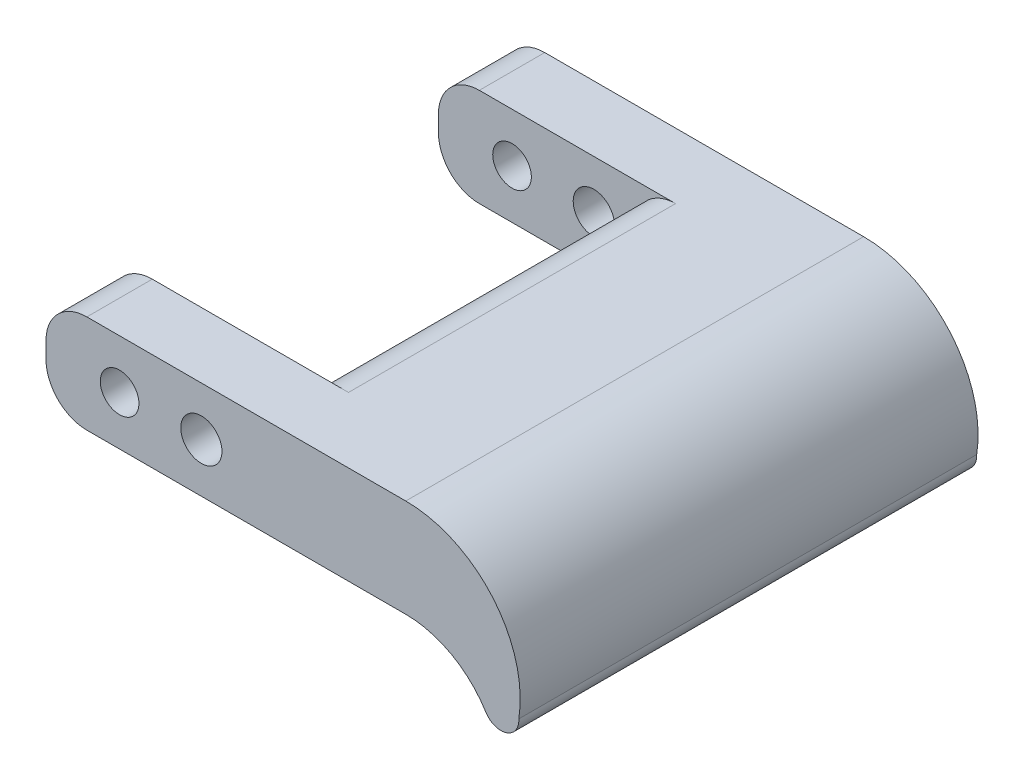
ISO-10303-21;
HEADER;
FILE_DESCRIPTION(('STEP AP214'),'2;1');
FILE_NAME('part.step','',(''),(''),'','','');
FILE_SCHEMA(('AUTOMOTIVE_DESIGN { 1 0 10303 214 1 1 1 1 }'));
ENDSEC;
DATA;
#1=APPLICATION_CONTEXT('core data for automotive mechanical design processes');
#2=APPLICATION_PROTOCOL_DEFINITION('international standard','automotive_design',2000,#1);
#3=PRODUCT_CONTEXT('',#1,'mechanical');
#4=PRODUCT('Part','Part','',(#3));
#5=PRODUCT_RELATED_PRODUCT_CATEGORY('part','',(#4));
#6=PRODUCT_DEFINITION_FORMATION('','',#4);
#7=PRODUCT_DEFINITION_CONTEXT('part definition',#1,'design');
#8=PRODUCT_DEFINITION('design','',#6,#7);
#9=PRODUCT_DEFINITION_SHAPE('','',#8);
#10=(LENGTH_UNIT() NAMED_UNIT(*) SI_UNIT(.MILLI.,.METRE.));
#11=(NAMED_UNIT(*) PLANE_ANGLE_UNIT() SI_UNIT($,.RADIAN.));
#12=(NAMED_UNIT(*) SI_UNIT($,.STERADIAN.) SOLID_ANGLE_UNIT());
#13=UNCERTAINTY_MEASURE_WITH_UNIT(LENGTH_MEASURE(1.E-05),#10,'distance_accuracy_value','');
#14=(GEOMETRIC_REPRESENTATION_CONTEXT(3) GLOBAL_UNCERTAINTY_ASSIGNED_CONTEXT((#13)) GLOBAL_UNIT_ASSIGNED_CONTEXT((#10,
#11,#12)) REPRESENTATION_CONTEXT('',''));
#15=CARTESIAN_POINT('',(0.,0.,0.));
#16=DIRECTION('',(0.,0.,1.));
#17=DIRECTION('',(1.,0.,0.));
#18=AXIS2_PLACEMENT_3D('',#15,#16,#17);
#19=CARTESIAN_POINT('',(0.,7.62,-30.48));
#20=DIRECTION('',(0.,0.,-1.));
#21=DIRECTION('',(-1.,0.,0.));
#22=AXIS2_PLACEMENT_3D('',#19,#20,#21);
#23=PLANE('',#22);
#24=CARTESIAN_POINT('',(5.715,3.81,-30.48));
#25=DIRECTION('',(0.,0.,-1.));
#26=DIRECTION('',(-1.,0.,0.));
#27=AXIS2_PLACEMENT_3D('',#24,#25,#26);
#28=CIRCLE('',#27,1.5);
#29=CARTESIAN_POINT('',(4.215,3.81,-30.48));
#30=VERTEX_POINT('',#29);
#31=EDGE_CURVE('E207',#30,#30,#28,.T.);
#32=ORIENTED_EDGE('',*,*,#31,.T.);
#33=EDGE_LOOP('',(#32));
#34=FACE_BOUND('',#33,.T.);
#35=CARTESIAN_POINT('',(12.065,3.81,-30.48));
#36=DIRECTION('',(0.,0.,-1.));
#37=DIRECTION('',(-1.,0.,0.));
#38=AXIS2_PLACEMENT_3D('',#35,#36,#37);
#39=CIRCLE('',#38,1.6);
#40=CARTESIAN_POINT('',(10.465,3.81,-30.48));
#41=VERTEX_POINT('',#40);
#42=EDGE_CURVE('E201',#41,#41,#39,.T.);
#43=ORIENTED_EDGE('',*,*,#42,.T.);
#44=EDGE_LOOP('',(#43));
#45=FACE_BOUND('',#44,.T.);
#46=DIRECTION('',(0.,-1.,0.));
#47=VECTOR('',#46,1.);
#48=CARTESIAN_POINT('',(0.,7.62,-30.48));
#49=LINE('',#48,#47);
#50=CARTESIAN_POINT('',(0.,4.445,-30.48));
#51=VERTEX_POINT('',#50);
#52=CARTESIAN_POINT('',(0.,3.175,-30.48));
#53=VERTEX_POINT('',#52);
#54=EDGE_CURVE('E221',#51,#53,#49,.T.);
#55=ORIENTED_EDGE('',*,*,#54,.T.);
#56=CARTESIAN_POINT('',(3.175,3.175,-30.48));
#57=DIRECTION('',(0.,0.,-1.));
#58=DIRECTION('',(-1.,0.,0.));
#59=AXIS2_PLACEMENT_3D('',#56,#57,#58);
#60=CIRCLE('',#59,3.175);
#61=CARTESIAN_POINT('',(3.175,0.,-30.48));
#62=VERTEX_POINT('',#61);
#63=EDGE_CURVE('E278',#53,#62,#60,.F.);
#64=ORIENTED_EDGE('',*,*,#63,.T.);
#65=DIRECTION('',(1.,0.,0.));
#66=VECTOR('',#65,1.);
#67=CARTESIAN_POINT('',(0.,0.,-30.48));
#68=LINE('',#67,#66);
#69=CARTESIAN_POINT('',(18.415,0.,-30.48));
#70=VERTEX_POINT('',#69);
#71=EDGE_CURVE('E210',#62,#70,#68,.T.);
#72=ORIENTED_EDGE('',*,*,#71,.T.);
#73=CARTESIAN_POINT('',(18.415,3.175,-30.48));
#74=DIRECTION('',(0.,0.,-1.));
#75=DIRECTION('',(-1.,0.,0.));
#76=AXIS2_PLACEMENT_3D('',#73,#74,#75);
#77=CIRCLE('',#76,3.175);
#78=CARTESIAN_POINT('',(15.24,3.175,-30.48));
#79=VERTEX_POINT('',#78);
#80=EDGE_CURVE('E11',#70,#79,#77,.T.);
#81=ORIENTED_EDGE('',*,*,#80,.T.);
#82=DIRECTION('',(0.,-1.,0.));
#83=VECTOR('',#82,1.);
#84=CARTESIAN_POINT('',(15.24,7.62,-30.48));
#85=LINE('',#84,#83);
#86=CARTESIAN_POINT('',(15.24,4.445,-30.48));
#87=VERTEX_POINT('',#86);
#88=EDGE_CURVE('E243',#87,#79,#85,.T.);
#89=ORIENTED_EDGE('',*,*,#88,.F.);
#90=CARTESIAN_POINT('',(18.415,4.445,-30.48));
#91=DIRECTION('',(0.,0.,-1.));
#92=DIRECTION('',(-1.,0.,0.));
#93=AXIS2_PLACEMENT_3D('',#90,#91,#92);
#94=CIRCLE('',#93,3.175);
#95=CARTESIAN_POINT('',(18.415,7.62,-30.48));
#96=VERTEX_POINT('',#95);
#97=EDGE_CURVE('E293',#87,#96,#94,.T.);
#98=ORIENTED_EDGE('',*,*,#97,.T.);
#99=DIRECTION('',(1.,0.,0.));
#100=VECTOR('',#99,1.);
#101=CARTESIAN_POINT('',(0.,7.62,-30.48));
#102=LINE('',#101,#100);
#103=CARTESIAN_POINT('',(3.175,7.62,-30.48));
#104=VERTEX_POINT('',#103);
#105=EDGE_CURVE('E211',#104,#96,#102,.T.);
#106=ORIENTED_EDGE('',*,*,#105,.F.);
#107=CARTESIAN_POINT('',(3.175,4.445,-30.48));
#108=DIRECTION('',(0.,0.,-1.));
#109=DIRECTION('',(-1.,0.,0.));
#110=AXIS2_PLACEMENT_3D('',#107,#108,#109);
#111=CIRCLE('',#110,3.175);
#112=EDGE_CURVE('E276',#104,#51,#111,.F.);
#113=ORIENTED_EDGE('',*,*,#112,.T.);
#114=EDGE_LOOP('',(#55,#64,#72,#81,#89,#98,#106,#113));
#115=FACE_BOUND('',#114,.T.);
#116=ADVANCED_FACE('F36',(#34,#45,#115),#23,.F.);
#117=CARTESIAN_POINT('',(15.24,7.62,0.));
#118=DIRECTION('',(1.,0.,0.));
#119=DIRECTION('',(0.,0.,-1.));
#120=AXIS2_PLACEMENT_3D('',#117,#118,#119);
#121=PLANE('',#120);
#122=DIRECTION('',(0.,-1.,0.));
#123=VECTOR('',#122,1.);
#124=CARTESIAN_POINT('',(15.24,7.62,-5.07999999999999));
#125=LINE('',#124,#123);
#126=CARTESIAN_POINT('',(15.24,4.445,-5.07999999999999));
#127=VERTEX_POINT('',#126);
#128=CARTESIAN_POINT('',(15.24,3.175,-5.07999999999999));
#129=VERTEX_POINT('',#128);
#130=EDGE_CURVE('E240',#127,#129,#125,.T.);
#131=ORIENTED_EDGE('',*,*,#130,.F.);
#132=DIRECTION('',(0.,0.,1.));
#133=VECTOR('',#132,1.);
#134=CARTESIAN_POINT('',(15.24,4.445,-30.48));
#135=LINE('',#134,#133);
#136=EDGE_CURVE('E256',#127,#87,#135,.F.);
#137=ORIENTED_EDGE('',*,*,#136,.T.);
#138=ORIENTED_EDGE('',*,*,#88,.T.);
#139=DIRECTION('',(0.,0.,1.));
#140=VECTOR('',#139,1.);
#141=CARTESIAN_POINT('',(15.24,3.175,0.));
#142=LINE('',#141,#140);
#143=EDGE_CURVE('E253',#79,#129,#142,.T.);
#144=ORIENTED_EDGE('',*,*,#143,.T.);
#145=EDGE_LOOP('',(#131,#137,#138,#144));
#146=FACE_BOUND('',#145,.T.);
#147=ADVANCED_FACE('F331',(#146),#121,.F.);
#148=CARTESIAN_POINT('',(0.,7.62,-5.07999999999999));
#149=DIRECTION('',(0.,0.,-1.));
#150=DIRECTION('',(-1.,0.,0.));
#151=AXIS2_PLACEMENT_3D('',#148,#149,#150);
#152=PLANE('',#151);
#153=CARTESIAN_POINT('',(5.715,3.81,-5.07999999999999));
#154=DIRECTION('',(0.,0.,-1.));
#155=DIRECTION('',(-1.,0.,0.));
#156=AXIS2_PLACEMENT_3D('',#153,#154,#155);
#157=CIRCLE('',#156,1.5);
#158=CARTESIAN_POINT('',(4.215,3.81,-5.07999999999999));
#159=VERTEX_POINT('',#158);
#160=EDGE_CURVE('E204',#159,#159,#157,.T.);
#161=ORIENTED_EDGE('',*,*,#160,.F.);
#162=EDGE_LOOP('',(#161));
#163=FACE_BOUND('',#162,.T.);
#164=CARTESIAN_POINT('',(12.065,3.81,-5.07999999999999));
#165=DIRECTION('',(0.,0.,-1.));
#166=DIRECTION('',(-1.,0.,0.));
#167=AXIS2_PLACEMENT_3D('',#164,#165,#166);
#168=CIRCLE('',#167,1.6);
#169=CARTESIAN_POINT('',(10.465,3.81,-5.07999999999999));
#170=VERTEX_POINT('',#169);
#171=EDGE_CURVE('E190',#170,#170,#168,.T.);
#172=ORIENTED_EDGE('',*,*,#171,.F.);
#173=EDGE_LOOP('',(#172));
#174=FACE_BOUND('',#173,.T.);
#175=DIRECTION('',(1.,0.,0.));
#176=VECTOR('',#175,1.);
#177=CARTESIAN_POINT('',(0.,0.,-5.07999999999999));
#178=LINE('',#177,#176);
#179=CARTESIAN_POINT('',(3.175,0.,-5.07999999999999));
#180=VERTEX_POINT('',#179);
#181=CARTESIAN_POINT('',(18.415,0.,-5.07999999999999));
#182=VERTEX_POINT('',#181);
#183=EDGE_CURVE('E223',#180,#182,#178,.T.);
#184=ORIENTED_EDGE('',*,*,#183,.F.);
#185=CARTESIAN_POINT('',(3.175,3.175,-5.07999999999999));
#186=DIRECTION('',(0.,0.,-1.));
#187=DIRECTION('',(-1.,0.,0.));
#188=AXIS2_PLACEMENT_3D('',#185,#186,#187);
#189=CIRCLE('',#188,3.175);
#190=CARTESIAN_POINT('',(0.,3.175,-5.07999999999999));
#191=VERTEX_POINT('',#190);
#192=EDGE_CURVE('E282',#180,#191,#189,.T.);
#193=ORIENTED_EDGE('',*,*,#192,.T.);
#194=DIRECTION('',(0.,-1.,0.));
#195=VECTOR('',#194,1.);
#196=CARTESIAN_POINT('',(0.,7.62,-5.07999999999999));
#197=LINE('',#196,#195);
#198=CARTESIAN_POINT('',(0.,4.445,-5.07999999999999));
#199=VERTEX_POINT('',#198);
#200=EDGE_CURVE('E238',#199,#191,#197,.T.);
#201=ORIENTED_EDGE('',*,*,#200,.F.);
#202=CARTESIAN_POINT('',(3.175,4.445,-5.07999999999999));
#203=DIRECTION('',(0.,0.,-1.));
#204=DIRECTION('',(-1.,0.,0.));
#205=AXIS2_PLACEMENT_3D('',#202,#203,#204);
#206=CIRCLE('',#205,3.175);
#207=CARTESIAN_POINT('',(3.175,7.62,-5.07999999999999));
#208=VERTEX_POINT('',#207);
#209=EDGE_CURVE('E280',#199,#208,#206,.T.);
#210=ORIENTED_EDGE('',*,*,#209,.T.);
#211=DIRECTION('',(1.,0.,0.));
#212=VECTOR('',#211,1.);
#213=CARTESIAN_POINT('',(0.,7.62,-5.07999999999999));
#214=LINE('',#213,#212);
#215=CARTESIAN_POINT('',(18.415,7.62,-5.07999999999999));
#216=VERTEX_POINT('',#215);
#217=EDGE_CURVE('E213',#208,#216,#214,.T.);
#218=ORIENTED_EDGE('',*,*,#217,.T.);
#219=CARTESIAN_POINT('',(18.415,4.445,-5.07999999999999));
#220=DIRECTION('',(0.,0.,-1.));
#221=DIRECTION('',(-1.,0.,0.));
#222=AXIS2_PLACEMENT_3D('',#219,#220,#221);
#223=CIRCLE('',#222,3.175);
#224=EDGE_CURVE('E291',#216,#127,#223,.F.);
#225=ORIENTED_EDGE('',*,*,#224,.T.);
#226=ORIENTED_EDGE('',*,*,#130,.T.);
#227=CARTESIAN_POINT('',(18.415,3.175,-5.07999999999999));
#228=DIRECTION('',(0.,0.,-1.));
#229=DIRECTION('',(-1.,0.,0.));
#230=AXIS2_PLACEMENT_3D('',#227,#228,#229);
#231=CIRCLE('',#230,3.175);
#232=EDGE_CURVE('E44',#129,#182,#231,.F.);
#233=ORIENTED_EDGE('',*,*,#232,.T.);
#234=EDGE_LOOP('',(#184,#193,#201,#210,#218,#225,#226,#233));
#235=FACE_BOUND('',#234,.T.);
#236=ADVANCED_FACE('F299',(#163,#174,#235),#152,.T.);
#237=CARTESIAN_POINT('',(0.,7.62,0.));
#238=DIRECTION('',(-1.,0.,0.));
#239=DIRECTION('',(0.,0.,1.));
#240=AXIS2_PLACEMENT_3D('',#237,#238,#239);
#241=PLANE('',#240);
#242=ORIENTED_EDGE('',*,*,#200,.T.);
#243=DIRECTION('',(0.,0.,-1.));
#244=VECTOR('',#243,1.);
#245=CARTESIAN_POINT('',(0.,3.175,0.));
#246=LINE('',#245,#244);
#247=CARTESIAN_POINT('',(0.,3.175,0.));
#248=VERTEX_POINT('',#247);
#249=EDGE_CURVE('E51',#191,#248,#246,.F.);
#250=ORIENTED_EDGE('',*,*,#249,.T.);
#251=DIRECTION('',(0.,-1.,0.));
#252=VECTOR('',#251,1.);
#253=CARTESIAN_POINT('',(0.,7.62,0.));
#254=LINE('',#253,#252);
#255=CARTESIAN_POINT('',(0.,4.445,0.));
#256=VERTEX_POINT('',#255);
#257=EDGE_CURVE('E236',#256,#248,#254,.T.);
#258=ORIENTED_EDGE('',*,*,#257,.F.);
#259=DIRECTION('',(0.,0.,-1.));
#260=VECTOR('',#259,1.);
#261=CARTESIAN_POINT('',(0.,4.445,0.));
#262=LINE('',#261,#260);
#263=EDGE_CURVE('E284',#256,#199,#262,.T.);
#264=ORIENTED_EDGE('',*,*,#263,.T.);
#265=EDGE_LOOP('',(#242,#250,#258,#264));
#266=FACE_BOUND('',#265,.T.);
#267=ADVANCED_FACE('F316',(#266),#241,.T.);
#268=CARTESIAN_POINT('',(0.,7.62,0.));
#269=DIRECTION('',(0.,0.,-1.));
#270=DIRECTION('',(-1.,0.,0.));
#271=AXIS2_PLACEMENT_3D('',#268,#269,#270);
#272=PLANE('',#271);
#273=CARTESIAN_POINT('',(5.715,3.81,0.));
#274=DIRECTION('',(0.,0.,1.));
#275=DIRECTION('',(1.,0.,0.));
#276=AXIS2_PLACEMENT_3D('',#273,#274,#275);
#277=CIRCLE('',#276,1.5);
#278=CARTESIAN_POINT('',(7.215,3.81,0.));
#279=VERTEX_POINT('',#278);
#280=EDGE_CURVE('E191',#279,#279,#277,.T.);
#281=ORIENTED_EDGE('',*,*,#280,.F.);
#282=EDGE_LOOP('',(#281));
#283=FACE_BOUND('',#282,.T.);
#284=CARTESIAN_POINT('',(12.065,3.81,0.));
#285=DIRECTION('',(0.,0.,1.));
#286=DIRECTION('',(1.,0.,0.));
#287=AXIS2_PLACEMENT_3D('',#284,#285,#286);
#288=CIRCLE('',#287,1.6);
#289=CARTESIAN_POINT('',(13.665,3.81,0.));
#290=VERTEX_POINT('',#289);
#291=EDGE_CURVE('E173',#290,#290,#288,.T.);
#292=ORIENTED_EDGE('',*,*,#291,.F.);
#293=EDGE_LOOP('',(#292));
#294=FACE_BOUND('',#293,.T.);
#295=ORIENTED_EDGE('',*,*,#257,.T.);
#296=CARTESIAN_POINT('',(3.175,3.175,0.));
#297=DIRECTION('',(0.,0.,-1.));
#298=DIRECTION('',(-1.,0.,0.));
#299=AXIS2_PLACEMENT_3D('',#296,#297,#298);
#300=CIRCLE('',#299,3.175);
#301=CARTESIAN_POINT('',(3.175,0.,0.));
#302=VERTEX_POINT('',#301);
#303=EDGE_CURVE('E289',#248,#302,#300,.F.);
#304=ORIENTED_EDGE('',*,*,#303,.T.);
#305=DIRECTION('',(1.,0.,0.));
#306=VECTOR('',#305,1.);
#307=CARTESIAN_POINT('',(0.,0.,0.));
#308=LINE('',#307,#306);
#309=CARTESIAN_POINT('',(27.94,0.,0.));
#310=VERTEX_POINT('',#309);
#311=EDGE_CURVE('E225',#302,#310,#308,.T.);
#312=ORIENTED_EDGE('',*,*,#311,.T.);
#313=CARTESIAN_POINT('',(27.94,-7.30271706890778,0.));
#314=DIRECTION('',(0.,0.,-1.));
#315=DIRECTION('',(-1.,0.,0.));
#316=AXIS2_PLACEMENT_3D('',#313,#314,#315);
#317=CIRCLE('',#316,7.30271706890777);
#318=CARTESIAN_POINT('',(34.1531229173718,-3.46516834581041,0.));
#319=VERTEX_POINT('',#318);
#320=EDGE_CURVE('E163',#310,#319,#317,.T.);
#321=ORIENTED_EDGE('',*,*,#320,.T.);
#322=CARTESIAN_POINT('',(35.3354544448919,-2.73489873678235,0.));
#323=DIRECTION('',(0.,0.,1.));
#324=DIRECTION('',(1.,0.,0.));
#325=AXIS2_PLACEMENT_3D('',#322,#323,#324);
#326=CIRCLE('',#325,1.3896767763901);
#327=CARTESIAN_POINT('',(36.7223621412549,-2.64721416227258,0.));
#328=VERTEX_POINT('',#327);
#329=EDGE_CURVE('E182',#319,#328,#326,.T.);
#330=ORIENTED_EDGE('',*,*,#329,.T.);
#331=CARTESIAN_POINT('',(27.94,-1.26973233386383,0.));
#332=DIRECTION('',(0.,0.,-1.));
#333=DIRECTION('',(-1.,0.,0.));
#334=AXIS2_PLACEMENT_3D('',#331,#332,#333);
#335=CIRCLE('',#334,8.88973233386383);
#336=CARTESIAN_POINT('',(27.94,7.62,0.));
#337=VERTEX_POINT('',#336);
#338=EDGE_CURVE('E169',#337,#328,#335,.T.);
#339=ORIENTED_EDGE('',*,*,#338,.F.);
#340=DIRECTION('',(1.,0.,0.));
#341=VECTOR('',#340,1.);
#342=CARTESIAN_POINT('',(0.,7.62,0.));
#343=LINE('',#342,#341);
#344=CARTESIAN_POINT('',(3.175,7.62,0.));
#345=VERTEX_POINT('',#344);
#346=EDGE_CURVE('E216',#345,#337,#343,.T.);
#347=ORIENTED_EDGE('',*,*,#346,.F.);
#348=CARTESIAN_POINT('',(3.175,4.445,0.));
#349=DIRECTION('',(0.,0.,-1.));
#350=DIRECTION('',(-1.,0.,0.));
#351=AXIS2_PLACEMENT_3D('',#348,#349,#350);
#352=CIRCLE('',#351,3.175);
#353=EDGE_CURVE('E58',#345,#256,#352,.F.);
#354=ORIENTED_EDGE('',*,*,#353,.T.);
#355=EDGE_LOOP('',(#295,#304,#312,#321,#330,#339,#347,#354));
#356=FACE_BOUND('',#355,.T.);
#357=ADVANCED_FACE('F343',(#283,#294,#356),#272,.F.);
#358=CARTESIAN_POINT('',(0.,7.62,-35.56));
#359=DIRECTION('',(0.,0.,-1.));
#360=DIRECTION('',(-1.,0.,0.));
#361=AXIS2_PLACEMENT_3D('',#358,#359,#360);
#362=PLANE('',#361);
#363=CARTESIAN_POINT('',(5.715,3.81,-35.56));
#364=DIRECTION('',(0.,0.,1.));
#365=DIRECTION('',(1.,0.,0.));
#366=AXIS2_PLACEMENT_3D('',#363,#364,#365);
#367=CIRCLE('',#366,1.5);
#368=CARTESIAN_POINT('',(7.215,3.81,-35.56));
#369=VERTEX_POINT('',#368);
#370=EDGE_CURVE('E187',#369,#369,#367,.T.);
#371=ORIENTED_EDGE('',*,*,#370,.T.);
#372=EDGE_LOOP('',(#371));
#373=FACE_BOUND('',#372,.T.);
#374=CARTESIAN_POINT('',(12.065,3.81,-35.56));
#375=DIRECTION('',(0.,0.,1.));
#376=DIRECTION('',(1.,0.,0.));
#377=AXIS2_PLACEMENT_3D('',#374,#375,#376);
#378=CIRCLE('',#377,1.6);
#379=CARTESIAN_POINT('',(13.665,3.81,-35.56));
#380=VERTEX_POINT('',#379);
#381=EDGE_CURVE('E194',#380,#380,#378,.T.);
#382=ORIENTED_EDGE('',*,*,#381,.T.);
#383=EDGE_LOOP('',(#382));
#384=FACE_BOUND('',#383,.T.);
#385=DIRECTION('',(1.,0.,0.));
#386=VECTOR('',#385,1.);
#387=CARTESIAN_POINT('',(0.,0.,-35.56));
#388=LINE('',#387,#386);
#389=CARTESIAN_POINT('',(3.175,0.,-35.56));
#390=VERTEX_POINT('',#389);
#391=CARTESIAN_POINT('',(27.94,0.,-35.56));
#392=VERTEX_POINT('',#391);
#393=EDGE_CURVE('E214',#390,#392,#388,.T.);
#394=ORIENTED_EDGE('',*,*,#393,.F.);
#395=CARTESIAN_POINT('',(3.175,3.175,-35.56));
#396=DIRECTION('',(0.,0.,-1.));
#397=DIRECTION('',(-1.,0.,0.));
#398=AXIS2_PLACEMENT_3D('',#395,#396,#397);
#399=CIRCLE('',#398,3.175);
#400=CARTESIAN_POINT('',(0.,3.175,-35.56));
#401=VERTEX_POINT('',#400);
#402=EDGE_CURVE('E269',#390,#401,#399,.T.);
#403=ORIENTED_EDGE('',*,*,#402,.T.);
#404=DIRECTION('',(0.,-1.,0.));
#405=VECTOR('',#404,1.);
#406=CARTESIAN_POINT('',(0.,7.62,-35.56));
#407=LINE('',#406,#405);
#408=CARTESIAN_POINT('',(0.,4.445,-35.56));
#409=VERTEX_POINT('',#408);
#410=EDGE_CURVE('E233',#409,#401,#407,.T.);
#411=ORIENTED_EDGE('',*,*,#410,.F.);
#412=CARTESIAN_POINT('',(3.175,4.445,-35.56));
#413=DIRECTION('',(0.,0.,-1.));
#414=DIRECTION('',(-1.,0.,0.));
#415=AXIS2_PLACEMENT_3D('',#412,#413,#414);
#416=CIRCLE('',#415,3.175);
#417=CARTESIAN_POINT('',(3.175,7.62,-35.56));
#418=VERTEX_POINT('',#417);
#419=EDGE_CURVE('E267',#409,#418,#416,.T.);
#420=ORIENTED_EDGE('',*,*,#419,.T.);
#421=DIRECTION('',(1.,0.,0.));
#422=VECTOR('',#421,1.);
#423=CARTESIAN_POINT('',(0.,7.62,-35.56));
#424=LINE('',#423,#422);
#425=CARTESIAN_POINT('',(27.94,7.62,-35.56));
#426=VERTEX_POINT('',#425);
#427=EDGE_CURVE('E159',#418,#426,#424,.T.);
#428=ORIENTED_EDGE('',*,*,#427,.T.);
#429=CARTESIAN_POINT('',(27.94,-1.26973233386383,-35.56));
#430=DIRECTION('',(0.,0.,-1.));
#431=DIRECTION('',(-1.,0.,0.));
#432=AXIS2_PLACEMENT_3D('',#429,#430,#431);
#433=CIRCLE('',#432,8.88973233386383);
#434=CARTESIAN_POINT('',(36.7223621412549,-2.64721416227258,-35.56));
#435=VERTEX_POINT('',#434);
#436=EDGE_CURVE('E150',#426,#435,#433,.T.);
#437=ORIENTED_EDGE('',*,*,#436,.T.);
#438=CARTESIAN_POINT('',(35.3354544448919,-2.73489873678235,-35.56));
#439=DIRECTION('',(0.,0.,1.));
#440=DIRECTION('',(1.,0.,0.));
#441=AXIS2_PLACEMENT_3D('',#438,#439,#440);
#442=CIRCLE('',#441,1.3896767763901);
#443=CARTESIAN_POINT('',(34.1531229173718,-3.46516834581041,-35.56));
#444=VERTEX_POINT('',#443);
#445=EDGE_CURVE('E156',#444,#435,#442,.T.);
#446=ORIENTED_EDGE('',*,*,#445,.F.);
#447=CARTESIAN_POINT('',(27.94,-7.30271706890778,-35.56));
#448=DIRECTION('',(0.,0.,-1.));
#449=DIRECTION('',(-1.,0.,0.));
#450=AXIS2_PLACEMENT_3D('',#447,#448,#449);
#451=CIRCLE('',#450,7.30271706890777);
#452=EDGE_CURVE('E177',#392,#444,#451,.T.);
#453=ORIENTED_EDGE('',*,*,#452,.F.);
#454=EDGE_LOOP('',(#394,#403,#411,#420,#428,#437,#446,#453));
#455=FACE_BOUND('',#454,.T.);
#456=ADVANCED_FACE('F153',(#373,#384,#455),#362,.T.);
#457=ORIENTED_EDGE('',*,*,#410,.T.);
#458=DIRECTION('',(0.,0.,-1.));
#459=VECTOR('',#458,1.);
#460=CARTESIAN_POINT('',(0.,3.175,-30.48));
#461=LINE('',#460,#459);
#462=EDGE_CURVE('E274',#401,#53,#461,.F.);
#463=ORIENTED_EDGE('',*,*,#462,.T.);
#464=ORIENTED_EDGE('',*,*,#54,.F.);
#465=DIRECTION('',(0.,0.,-1.));
#466=VECTOR('',#465,1.);
#467=CARTESIAN_POINT('',(0.,4.445,0.));
#468=LINE('',#467,#466);
#469=EDGE_CURVE('E271',#51,#409,#468,.T.);
#470=ORIENTED_EDGE('',*,*,#469,.T.);
#471=EDGE_LOOP('',(#457,#463,#464,#470));
#472=FACE_BOUND('',#471,.T.);
#473=ADVANCED_FACE('F350',(#472),#241,.T.);
#474=CARTESIAN_POINT('',(0.,7.62,0.));
#475=DIRECTION('',(0.,1.,0.));
#476=DIRECTION('',(0.,0.,1.));
#477=AXIS2_PLACEMENT_3D('',#474,#475,#476);
#478=PLANE('',#477);
#479=DIRECTION('',(0.,0.,1.));
#480=VECTOR('',#479,1.);
#481=CARTESIAN_POINT('',(18.415,7.62,-5.07999999999999));
#482=LINE('',#481,#480);
#483=EDGE_CURVE('E250',#96,#216,#482,.T.);
#484=ORIENTED_EDGE('',*,*,#483,.T.);
#485=ORIENTED_EDGE('',*,*,#217,.F.);
#486=DIRECTION('',(0.,0.,-1.));
#487=VECTOR('',#486,1.);
#488=CARTESIAN_POINT('',(3.175,7.62,0.));
#489=LINE('',#488,#487);
#490=EDGE_CURVE('E246',#208,#345,#489,.F.);
#491=ORIENTED_EDGE('',*,*,#490,.T.);
#492=ORIENTED_EDGE('',*,*,#346,.T.);
#493=DIRECTION('',(0.,0.,-1.));
#494=VECTOR('',#493,1.);
#495=CARTESIAN_POINT('',(27.94,7.62,0.));
#496=LINE('',#495,#494);
#497=EDGE_CURVE('E218',#337,#426,#496,.T.);
#498=ORIENTED_EDGE('',*,*,#497,.T.);
#499=ORIENTED_EDGE('',*,*,#427,.F.);
#500=DIRECTION('',(0.,0.,-1.));
#501=VECTOR('',#500,1.);
#502=CARTESIAN_POINT('',(3.175,7.62,0.));
#503=LINE('',#502,#501);
#504=EDGE_CURVE('E248',#418,#104,#503,.F.);
#505=ORIENTED_EDGE('',*,*,#504,.T.);
#506=ORIENTED_EDGE('',*,*,#105,.T.);
#507=EDGE_LOOP('',(#484,#485,#491,#492,#498,#499,#505,#506));
#508=FACE_BOUND('',#507,.T.);
#509=ADVANCED_FACE('F323',(#508),#478,.T.);
#510=CARTESIAN_POINT('',(0.,0.,0.));
#511=DIRECTION('',(0.,1.,0.));
#512=DIRECTION('',(0.,0.,1.));
#513=AXIS2_PLACEMENT_3D('',#510,#511,#512);
#514=PLANE('',#513);
#515=ORIENTED_EDGE('',*,*,#183,.T.);
#516=DIRECTION('',(0.,0.,1.));
#517=VECTOR('',#516,1.);
#518=CARTESIAN_POINT('',(18.415,0.,0.));
#519=LINE('',#518,#517);
#520=EDGE_CURVE('E264',#182,#70,#519,.F.);
#521=ORIENTED_EDGE('',*,*,#520,.T.);
#522=ORIENTED_EDGE('',*,*,#71,.F.);
#523=DIRECTION('',(0.,0.,-1.));
#524=VECTOR('',#523,1.);
#525=CARTESIAN_POINT('',(3.175,0.,-35.56));
#526=LINE('',#525,#524);
#527=EDGE_CURVE('E261',#62,#390,#526,.T.);
#528=ORIENTED_EDGE('',*,*,#527,.T.);
#529=ORIENTED_EDGE('',*,*,#393,.T.);
#530=DIRECTION('',(0.,0.,-1.));
#531=VECTOR('',#530,1.);
#532=CARTESIAN_POINT('',(27.94,0.,0.));
#533=LINE('',#532,#531);
#534=EDGE_CURVE('E227',#310,#392,#533,.T.);
#535=ORIENTED_EDGE('',*,*,#534,.F.);
#536=ORIENTED_EDGE('',*,*,#311,.F.);
#537=DIRECTION('',(0.,0.,-1.));
#538=VECTOR('',#537,1.);
#539=CARTESIAN_POINT('',(3.175,0.,-5.07999999999999));
#540=LINE('',#539,#538);
#541=EDGE_CURVE('E258',#302,#180,#540,.T.);
#542=ORIENTED_EDGE('',*,*,#541,.T.);
#543=EDGE_LOOP('',(#515,#521,#522,#528,#529,#535,#536,#542));
#544=FACE_BOUND('',#543,.T.);
#545=ADVANCED_FACE('F307',(#544),#514,.F.);
#546=CARTESIAN_POINT('',(18.415,4.445,0.));
#547=DIRECTION('',(0.,0.,-1.));
#548=DIRECTION('',(-1.,0.,0.));
#549=AXIS2_PLACEMENT_3D('',#546,#547,#548);
#550=CYLINDRICAL_SURFACE('',#549,3.175);
#551=ORIENTED_EDGE('',*,*,#97,.F.);
#552=ORIENTED_EDGE('',*,*,#136,.F.);
#553=ORIENTED_EDGE('',*,*,#224,.F.);
#554=ORIENTED_EDGE('',*,*,#483,.F.);
#555=EDGE_LOOP('',(#551,#552,#553,#554));
#556=FACE_BOUND('',#555,.T.);
#557=ADVANCED_FACE('F328',(#556),#550,.T.);
#558=CARTESIAN_POINT('',(18.415,3.175,0.));
#559=DIRECTION('',(0.,0.,1.));
#560=DIRECTION('',(1.,0.,0.));
#561=AXIS2_PLACEMENT_3D('',#558,#559,#560);
#562=CYLINDRICAL_SURFACE('',#561,3.175);
#563=ORIENTED_EDGE('',*,*,#80,.F.);
#564=ORIENTED_EDGE('',*,*,#520,.F.);
#565=ORIENTED_EDGE('',*,*,#232,.F.);
#566=ORIENTED_EDGE('',*,*,#143,.F.);
#567=EDGE_LOOP('',(#563,#564,#565,#566));
#568=FACE_BOUND('',#567,.T.);
#569=ADVANCED_FACE('F304',(#568),#562,.T.);
#570=CARTESIAN_POINT('',(3.175,3.175,0.));
#571=DIRECTION('',(0.,0.,1.));
#572=DIRECTION('',(1.,0.,0.));
#573=AXIS2_PLACEMENT_3D('',#570,#571,#572);
#574=CYLINDRICAL_SURFACE('',#573,3.175);
#575=ORIENTED_EDGE('',*,*,#63,.F.);
#576=ORIENTED_EDGE('',*,*,#462,.F.);
#577=ORIENTED_EDGE('',*,*,#402,.F.);
#578=ORIENTED_EDGE('',*,*,#527,.F.);
#579=EDGE_LOOP('',(#575,#576,#577,#578));
#580=FACE_BOUND('',#579,.T.);
#581=ADVANCED_FACE('F338',(#580),#574,.T.);
#582=CARTESIAN_POINT('',(3.175,4.445,0.));
#583=DIRECTION('',(0.,0.,-1.));
#584=DIRECTION('',(-1.,0.,0.));
#585=AXIS2_PLACEMENT_3D('',#582,#583,#584);
#586=CYLINDRICAL_SURFACE('',#585,3.175);
#587=ORIENTED_EDGE('',*,*,#112,.F.);
#588=ORIENTED_EDGE('',*,*,#504,.F.);
#589=ORIENTED_EDGE('',*,*,#419,.F.);
#590=ORIENTED_EDGE('',*,*,#469,.F.);
#591=EDGE_LOOP('',(#587,#588,#589,#590));
#592=FACE_BOUND('',#591,.T.);
#593=ADVANCED_FACE('F347',(#592),#586,.T.);
#594=CARTESIAN_POINT('',(3.175,3.175,0.));
#595=DIRECTION('',(0.,0.,1.));
#596=DIRECTION('',(1.,0.,0.));
#597=AXIS2_PLACEMENT_3D('',#594,#595,#596);
#598=CYLINDRICAL_SURFACE('',#597,3.175);
#599=ORIENTED_EDGE('',*,*,#303,.F.);
#600=ORIENTED_EDGE('',*,*,#249,.F.);
#601=ORIENTED_EDGE('',*,*,#192,.F.);
#602=ORIENTED_EDGE('',*,*,#541,.F.);
#603=EDGE_LOOP('',(#599,#600,#601,#602));
#604=FACE_BOUND('',#603,.T.);
#605=ADVANCED_FACE('F314',(#604),#598,.T.);
#606=CARTESIAN_POINT('',(3.175,4.445,0.));
#607=DIRECTION('',(0.,0.,-1.));
#608=DIRECTION('',(-1.,0.,0.));
#609=AXIS2_PLACEMENT_3D('',#606,#607,#608);
#610=CYLINDRICAL_SURFACE('',#609,3.175);
#611=ORIENTED_EDGE('',*,*,#353,.F.);
#612=ORIENTED_EDGE('',*,*,#490,.F.);
#613=ORIENTED_EDGE('',*,*,#209,.F.);
#614=ORIENTED_EDGE('',*,*,#263,.F.);
#615=EDGE_LOOP('',(#611,#612,#613,#614));
#616=FACE_BOUND('',#615,.T.);
#617=ADVANCED_FACE('F38',(#616),#610,.T.);
#618=CARTESIAN_POINT('',(12.065,3.81,-35.56));
#619=DIRECTION('',(0.,0.,1.));
#620=DIRECTION('',(1.,0.,0.));
#621=AXIS2_PLACEMENT_3D('',#618,#619,#620);
#622=CYLINDRICAL_SURFACE('',#621,1.6);
#623=ORIENTED_EDGE('',*,*,#381,.F.);
#624=EDGE_LOOP('',(#623));
#625=FACE_BOUND('',#624,.T.);
#626=ORIENTED_EDGE('',*,*,#42,.F.);
#627=EDGE_LOOP('',(#626));
#628=FACE_BOUND('',#627,.T.);
#629=ADVANCED_FACE('F383',(#625,#628),#622,.F.);
#630=CARTESIAN_POINT('',(5.715,3.81,-35.56));
#631=DIRECTION('',(0.,0.,1.));
#632=DIRECTION('',(1.,0.,0.));
#633=AXIS2_PLACEMENT_3D('',#630,#631,#632);
#634=CYLINDRICAL_SURFACE('',#633,1.5);
#635=ORIENTED_EDGE('',*,*,#370,.F.);
#636=EDGE_LOOP('',(#635));
#637=FACE_BOUND('',#636,.T.);
#638=ORIENTED_EDGE('',*,*,#31,.F.);
#639=EDGE_LOOP('',(#638));
#640=FACE_BOUND('',#639,.T.);
#641=ADVANCED_FACE('F387',(#637,#640),#634,.F.);
#642=ORIENTED_EDGE('',*,*,#171,.T.);
#643=EDGE_LOOP('',(#642));
#644=FACE_BOUND('',#643,.T.);
#645=ORIENTED_EDGE('',*,*,#291,.T.);
#646=EDGE_LOOP('',(#645));
#647=FACE_BOUND('',#646,.T.);
#648=ADVANCED_FACE('F390',(#644,#647),#622,.F.);
#649=ORIENTED_EDGE('',*,*,#160,.T.);
#650=EDGE_LOOP('',(#649));
#651=FACE_BOUND('',#650,.T.);
#652=ORIENTED_EDGE('',*,*,#280,.T.);
#653=EDGE_LOOP('',(#652));
#654=FACE_BOUND('',#653,.T.);
#655=ADVANCED_FACE('F396',(#651,#654),#634,.F.);
#656=CARTESIAN_POINT('',(27.94,-1.26973233386383,-35.56));
#657=DIRECTION('',(0.,0.,1.));
#658=DIRECTION('',(1.,0.,0.));
#659=AXIS2_PLACEMENT_3D('',#656,#657,#658);
#660=CYLINDRICAL_SURFACE('',#659,8.88973233386383);
#661=ORIENTED_EDGE('',*,*,#338,.T.);
#662=DIRECTION('',(0.,0.,1.));
#663=VECTOR('',#662,1.);
#664=CARTESIAN_POINT('',(36.7223621412549,-2.64721416227258,-35.56));
#665=LINE('',#664,#663);
#666=EDGE_CURVE('E166',#435,#328,#665,.T.);
#667=ORIENTED_EDGE('',*,*,#666,.F.);
#668=ORIENTED_EDGE('',*,*,#436,.F.);
#669=ORIENTED_EDGE('',*,*,#497,.F.);
#670=EDGE_LOOP('',(#661,#667,#668,#669));
#671=FACE_BOUND('',#670,.T.);
#672=ADVANCED_FACE('F167',(#671),#660,.T.);
#673=CARTESIAN_POINT('',(35.3354544448919,-2.73489873678235,-35.56));
#674=DIRECTION('',(0.,0.,1.));
#675=DIRECTION('',(1.,0.,0.));
#676=AXIS2_PLACEMENT_3D('',#673,#674,#675);
#677=CYLINDRICAL_SURFACE('',#676,1.3896767763901);
#678=ORIENTED_EDGE('',*,*,#329,.F.);
#679=DIRECTION('',(0.,0.,1.));
#680=VECTOR('',#679,1.);
#681=CARTESIAN_POINT('',(34.1531229173718,-3.46516834581041,-35.56));
#682=LINE('',#681,#680);
#683=EDGE_CURVE('E174',#444,#319,#682,.T.);
#684=ORIENTED_EDGE('',*,*,#683,.F.);
#685=ORIENTED_EDGE('',*,*,#445,.T.);
#686=ORIENTED_EDGE('',*,*,#666,.T.);
#687=EDGE_LOOP('',(#678,#684,#685,#686));
#688=FACE_BOUND('',#687,.T.);
#689=ADVANCED_FACE('F176',(#688),#677,.T.);
#690=CARTESIAN_POINT('',(27.94,-7.30271706890778,-35.56));
#691=DIRECTION('',(0.,0.,1.));
#692=DIRECTION('',(1.,0.,0.));
#693=AXIS2_PLACEMENT_3D('',#690,#691,#692);
#694=CYLINDRICAL_SURFACE('',#693,7.30271706890777);
#695=ORIENTED_EDGE('',*,*,#320,.F.);
#696=ORIENTED_EDGE('',*,*,#534,.T.);
#697=ORIENTED_EDGE('',*,*,#452,.T.);
#698=ORIENTED_EDGE('',*,*,#683,.T.);
#699=EDGE_LOOP('',(#695,#696,#697,#698));
#700=FACE_BOUND('',#699,.T.);
#701=ADVANCED_FACE('F342',(#700),#694,.F.);
#702=CLOSED_SHELL('',(#116,#147,#236,#267,#357,#456,#473,#509,#545,#557,#569,#581,#593,#605,
#617,#629,#641,#648,#655,#672,#689,#701));
#703=MANIFOLD_SOLID_BREP('B2',#702);
#704=ADVANCED_BREP_SHAPE_REPRESENTATION('',(#18,#703),#14);
#705=SHAPE_DEFINITION_REPRESENTATION(#9,#704);
ENDSEC;
END-ISO-10303-21;
